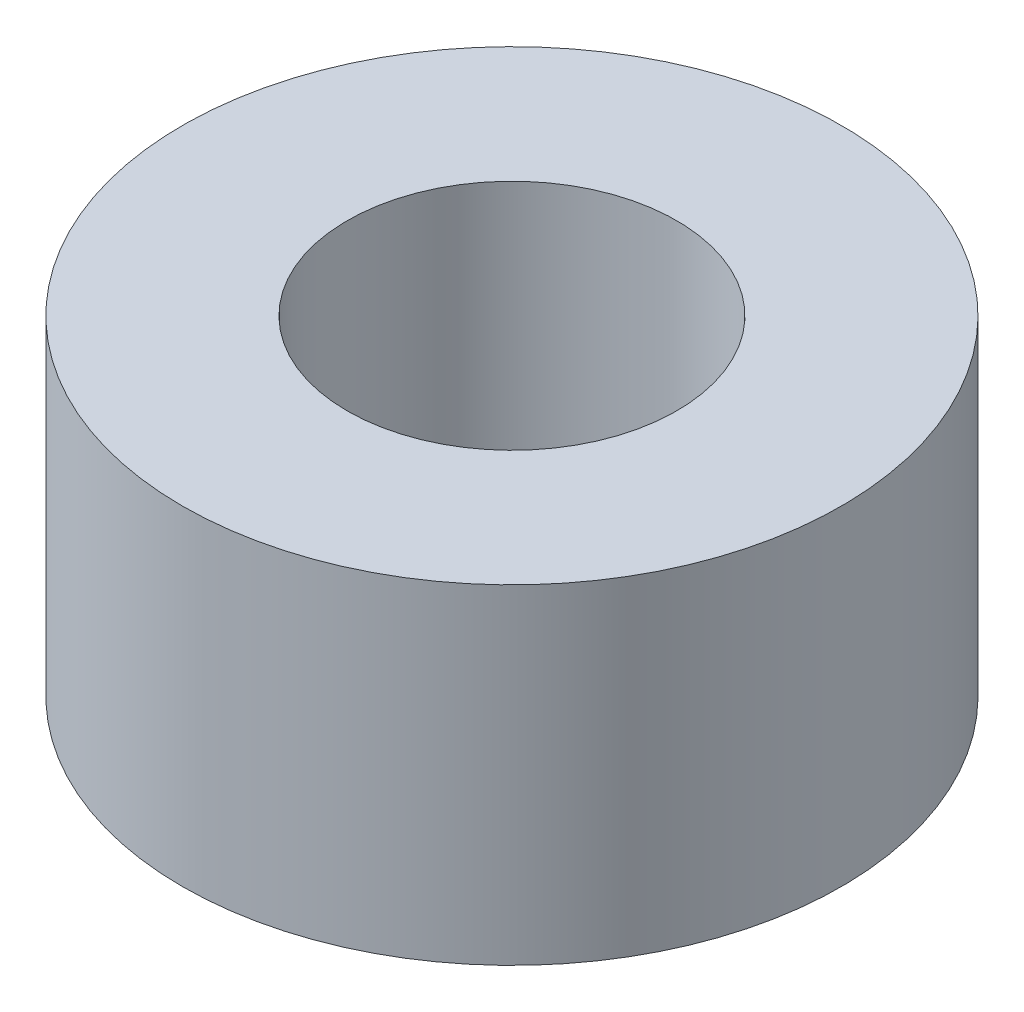
ISO-10303-21;
HEADER;
FILE_DESCRIPTION(('STEP AP214'),'2;1');
FILE_NAME('part.step','',(''),(''),'','','');
FILE_SCHEMA(('AUTOMOTIVE_DESIGN { 1 0 10303 214 1 1 1 1 }'));
ENDSEC;
DATA;
#1=APPLICATION_CONTEXT('core data for automotive mechanical design processes');
#2=APPLICATION_PROTOCOL_DEFINITION('international standard','automotive_design',2000,#1);
#3=PRODUCT_CONTEXT('',#1,'mechanical');
#4=PRODUCT('Part','Part','',(#3));
#5=PRODUCT_RELATED_PRODUCT_CATEGORY('part','',(#4));
#6=PRODUCT_DEFINITION_FORMATION('','',#4);
#7=PRODUCT_DEFINITION_CONTEXT('part definition',#1,'design');
#8=PRODUCT_DEFINITION('design','',#6,#7);
#9=PRODUCT_DEFINITION_SHAPE('','',#8);
#10=(LENGTH_UNIT() NAMED_UNIT(*) SI_UNIT(.MILLI.,.METRE.));
#11=(NAMED_UNIT(*) PLANE_ANGLE_UNIT() SI_UNIT($,.RADIAN.));
#12=(NAMED_UNIT(*) SI_UNIT($,.STERADIAN.) SOLID_ANGLE_UNIT());
#13=UNCERTAINTY_MEASURE_WITH_UNIT(LENGTH_MEASURE(1.E-05),#10,'distance_accuracy_value','');
#14=(GEOMETRIC_REPRESENTATION_CONTEXT(3) GLOBAL_UNCERTAINTY_ASSIGNED_CONTEXT((#13)) GLOBAL_UNIT_ASSIGNED_CONTEXT((#10,
#11,#12)) REPRESENTATION_CONTEXT('',''));
#15=CARTESIAN_POINT('',(0.,0.,0.));
#16=DIRECTION('',(0.,0.,1.));
#17=DIRECTION('',(1.,0.,0.));
#18=AXIS2_PLACEMENT_3D('',#15,#16,#17);
#19=CARTESIAN_POINT('',(0.,5.,0.));
#20=DIRECTION('',(0.,-1.,0.));
#21=DIRECTION('',(0.,0.,-1.));
#22=AXIS2_PLACEMENT_3D('',#19,#20,#21);
#23=CYLINDRICAL_SURFACE('',#22,5.);
#24=CARTESIAN_POINT('',(0.,5.,0.));
#25=DIRECTION('',(0.,1.,0.));
#26=DIRECTION('',(0.,0.,1.));
#27=AXIS2_PLACEMENT_3D('',#24,#25,#26);
#28=CIRCLE('',#27,5.);
#29=CARTESIAN_POINT('',(0.,5.,5.));
#30=VERTEX_POINT('',#29);
#31=EDGE_CURVE('E10',#30,#30,#28,.T.);
#32=ORIENTED_EDGE('',*,*,#31,.F.);
#33=EDGE_LOOP('',(#32));
#34=FACE_BOUND('',#33,.T.);
#35=CARTESIAN_POINT('',(0.,0.,0.));
#36=DIRECTION('',(0.,1.,0.));
#37=DIRECTION('',(0.,0.,1.));
#38=AXIS2_PLACEMENT_3D('',#35,#36,#37);
#39=CIRCLE('',#38,5.);
#40=CARTESIAN_POINT('',(0.,0.,5.));
#41=VERTEX_POINT('',#40);
#42=EDGE_CURVE('E37',#41,#41,#39,.T.);
#43=ORIENTED_EDGE('',*,*,#42,.T.);
#44=EDGE_LOOP('',(#43));
#45=FACE_BOUND('',#44,.T.);
#46=ADVANCED_FACE('F34',(#34,#45),#23,.T.);
#47=CARTESIAN_POINT('',(0.,5.,0.));
#48=DIRECTION('',(0.,1.,0.));
#49=DIRECTION('',(0.,0.,1.));
#50=AXIS2_PLACEMENT_3D('',#47,#48,#49);
#51=PLANE('',#50);
#52=CARTESIAN_POINT('',(0.,5.,0.));
#53=DIRECTION('',(0.,1.,0.));
#54=DIRECTION('',(0.,0.,1.));
#55=AXIS2_PLACEMENT_3D('',#52,#53,#54);
#56=CIRCLE('',#55,2.5);
#57=CARTESIAN_POINT('',(0.,5.,2.5));
#58=VERTEX_POINT('',#57);
#59=EDGE_CURVE('E46',#58,#58,#56,.T.);
#60=ORIENTED_EDGE('',*,*,#59,.F.);
#61=EDGE_LOOP('',(#60));
#62=FACE_BOUND('',#61,.T.);
#63=ORIENTED_EDGE('',*,*,#31,.T.);
#64=EDGE_LOOP('',(#63));
#65=FACE_BOUND('',#64,.T.);
#66=ADVANCED_FACE('F61',(#62,#65),#51,.T.);
#67=CARTESIAN_POINT('',(0.,0.,0.));
#68=DIRECTION('',(0.,1.,0.));
#69=DIRECTION('',(0.,0.,1.));
#70=AXIS2_PLACEMENT_3D('',#67,#68,#69);
#71=PLANE('',#70);
#72=CARTESIAN_POINT('',(0.,0.,0.));
#73=DIRECTION('',(0.,1.,0.));
#74=DIRECTION('',(0.,0.,1.));
#75=AXIS2_PLACEMENT_3D('',#72,#73,#74);
#76=CIRCLE('',#75,2.5);
#77=CARTESIAN_POINT('',(0.,0.,2.5));
#78=VERTEX_POINT('',#77);
#79=EDGE_CURVE('E44',#78,#78,#76,.T.);
#80=ORIENTED_EDGE('',*,*,#79,.T.);
#81=EDGE_LOOP('',(#80));
#82=FACE_BOUND('',#81,.T.);
#83=ORIENTED_EDGE('',*,*,#42,.F.);
#84=EDGE_LOOP('',(#83));
#85=FACE_BOUND('',#84,.T.);
#86=ADVANCED_FACE('F52',(#82,#85),#71,.F.);
#87=CARTESIAN_POINT('',(0.,0.,0.));
#88=DIRECTION('',(0.,1.,0.));
#89=DIRECTION('',(0.,0.,1.));
#90=AXIS2_PLACEMENT_3D('',#87,#88,#89);
#91=CYLINDRICAL_SURFACE('',#90,2.5);
#92=ORIENTED_EDGE('',*,*,#79,.F.);
#93=EDGE_LOOP('',(#92));
#94=FACE_BOUND('',#93,.T.);
#95=ORIENTED_EDGE('',*,*,#59,.T.);
#96=EDGE_LOOP('',(#95));
#97=FACE_BOUND('',#96,.T.);
#98=ADVANCED_FACE('F55',(#94,#97),#91,.F.);
#99=CLOSED_SHELL('',(#46,#66,#86,#98));
#100=MANIFOLD_SOLID_BREP('B2',#99);
#101=ADVANCED_BREP_SHAPE_REPRESENTATION('',(#18,#100),#14);
#102=SHAPE_DEFINITION_REPRESENTATION(#9,#101);
ENDSEC;
END-ISO-10303-21;
